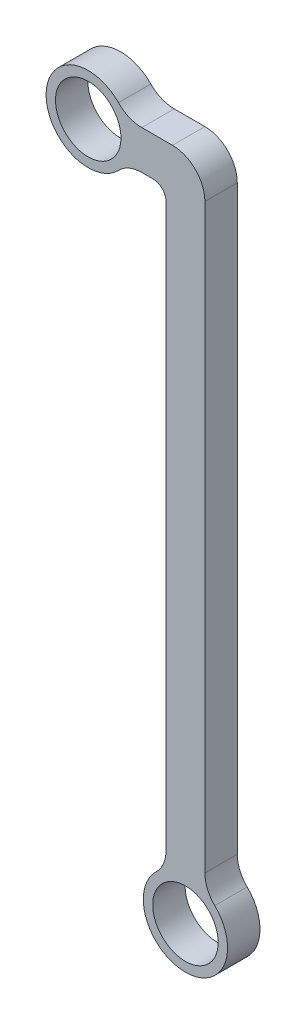
ISO-10303-21;
HEADER;
FILE_DESCRIPTION(('STEP AP214'),'2;1');
FILE_NAME('part.step','',(''),(''),'','','');
FILE_SCHEMA(('AUTOMOTIVE_DESIGN { 1 0 10303 214 1 1 1 1 }'));
ENDSEC;
DATA;
#1=APPLICATION_CONTEXT('core data for automotive mechanical design processes');
#2=APPLICATION_PROTOCOL_DEFINITION('international standard','automotive_design',2000,#1);
#3=PRODUCT_CONTEXT('',#1,'mechanical');
#4=PRODUCT('Part','Part','',(#3));
#5=PRODUCT_RELATED_PRODUCT_CATEGORY('part','',(#4));
#6=PRODUCT_DEFINITION_FORMATION('','',#4);
#7=PRODUCT_DEFINITION_CONTEXT('part definition',#1,'design');
#8=PRODUCT_DEFINITION('design','',#6,#7);
#9=PRODUCT_DEFINITION_SHAPE('','',#8);
#10=(LENGTH_UNIT() NAMED_UNIT(*) SI_UNIT(.MILLI.,.METRE.));
#11=(NAMED_UNIT(*) PLANE_ANGLE_UNIT() SI_UNIT($,.RADIAN.));
#12=(NAMED_UNIT(*) SI_UNIT($,.STERADIAN.) SOLID_ANGLE_UNIT());
#13=UNCERTAINTY_MEASURE_WITH_UNIT(LENGTH_MEASURE(1.E-05),#10,'distance_accuracy_value','');
#14=(GEOMETRIC_REPRESENTATION_CONTEXT(3) GLOBAL_UNCERTAINTY_ASSIGNED_CONTEXT((#13)) GLOBAL_UNIT_ASSIGNED_CONTEXT((#10,
#11,#12)) REPRESENTATION_CONTEXT('',''));
#15=CARTESIAN_POINT('',(0.,0.,0.));
#16=DIRECTION('',(0.,0.,1.));
#17=DIRECTION('',(1.,0.,0.));
#18=AXIS2_PLACEMENT_3D('',#15,#16,#17);
#19=CARTESIAN_POINT('',(12.7,-6.35,6.35));
#20=DIRECTION('',(0.,0.,1.));
#21=DIRECTION('',(1.,0.,0.));
#22=AXIS2_PLACEMENT_3D('',#19,#20,#21);
#23=PLANE('',#22);
#24=CARTESIAN_POINT('',(19.05,-127.,6.35));
#25=DIRECTION('',(0.,0.,1.));
#26=DIRECTION('',(1.,0.,0.));
#27=AXIS2_PLACEMENT_3D('',#24,#25,#26);
#28=CIRCLE('',#27,6.41349999999997);
#29=CARTESIAN_POINT('',(25.4635,-127.,6.35));
#30=VERTEX_POINT('',#29);
#31=EDGE_CURVE('E173',#30,#30,#28,.T.);
#32=ORIENTED_EDGE('',*,*,#31,.F.);
#33=EDGE_LOOP('',(#32));
#34=FACE_BOUND('',#33,.T.);
#35=CARTESIAN_POINT('',(12.7,-6.35,6.35));
#36=DIRECTION('',(0.,0.,-1.));
#37=DIRECTION('',(1.,0.,0.));
#38=AXIS2_PLACEMENT_3D('',#35,#36,#37);
#39=CIRCLE('',#38,2.54000000000001);
#40=CARTESIAN_POINT('',(12.7,-3.81,6.35));
#41=VERTEX_POINT('',#40);
#42=CARTESIAN_POINT('',(15.24,-6.35,6.35));
#43=VERTEX_POINT('',#42);
#44=EDGE_CURVE('E203',#41,#43,#39,.T.);
#45=ORIENTED_EDGE('',*,*,#44,.T.);
#46=DIRECTION('',(0.,-1.,0.));
#47=VECTOR('',#46,1.);
#48=CARTESIAN_POINT('',(15.24,-6.35,6.35));
#49=LINE('',#48,#47);
#50=CARTESIAN_POINT('',(15.24,-116.50807810742,6.35));
#51=VERTEX_POINT('',#50);
#52=EDGE_CURVE('E115',#43,#51,#49,.T.);
#53=ORIENTED_EDGE('',*,*,#52,.T.);
#54=CARTESIAN_POINT('',(8.89000000000001,-116.50807810742,6.35));
#55=DIRECTION('',(0.,0.,-1.));
#56=DIRECTION('',(-1.,0.,0.));
#57=AXIS2_PLACEMENT_3D('',#54,#55,#56);
#58=CIRCLE('',#57,6.35000000000001);
#59=CARTESIAN_POINT('',(13.3073913043478,-121.069783278107,6.35));
#60=VERTEX_POINT('',#59);
#61=EDGE_CURVE('E240',#51,#60,#58,.T.);
#62=ORIENTED_EDGE('',*,*,#61,.T.);
#63=CARTESIAN_POINT('',(19.05,-127.,6.35));
#64=DIRECTION('',(0.,0.,1.));
#65=DIRECTION('',(1.,0.,0.));
#66=AXIS2_PLACEMENT_3D('',#63,#64,#65);
#67=CIRCLE('',#66,8.25500000000002);
#68=CARTESIAN_POINT('',(24.7926086956522,-121.069783278107,6.35));
#69=VERTEX_POINT('',#68);
#70=EDGE_CURVE('E260',#60,#69,#67,.T.);
#71=ORIENTED_EDGE('',*,*,#70,.T.);
#72=CARTESIAN_POINT('',(29.21,-116.50807810742,6.35));
#73=DIRECTION('',(0.,0.,-1.));
#74=DIRECTION('',(1.,0.,0.));
#75=AXIS2_PLACEMENT_3D('',#72,#73,#74);
#76=CIRCLE('',#75,6.35000000000001);
#77=CARTESIAN_POINT('',(22.86,-116.50807810742,6.35));
#78=VERTEX_POINT('',#77);
#79=EDGE_CURVE('E256',#69,#78,#76,.T.);
#80=ORIENTED_EDGE('',*,*,#79,.T.);
#81=DIRECTION('',(0.,1.,0.));
#82=VECTOR('',#81,1.);
#83=CARTESIAN_POINT('',(22.86,-2.53999999999999,6.35));
#84=LINE('',#83,#82);
#85=CARTESIAN_POINT('',(22.86,-2.53999999999999,6.35));
#86=VERTEX_POINT('',#85);
#87=EDGE_CURVE('E259',#78,#86,#84,.T.);
#88=ORIENTED_EDGE('',*,*,#87,.T.);
#89=CARTESIAN_POINT('',(16.51,-2.53999999999999,6.35));
#90=DIRECTION('',(0.,0.,1.));
#91=DIRECTION('',(1.,0.,0.));
#92=AXIS2_PLACEMENT_3D('',#89,#90,#91);
#93=CIRCLE('',#92,6.35);
#94=CARTESIAN_POINT('',(16.51,3.81,6.35));
#95=VERTEX_POINT('',#94);
#96=EDGE_CURVE('E264',#86,#95,#93,.T.);
#97=ORIENTED_EDGE('',*,*,#96,.T.);
#98=DIRECTION('',(-1.,0.,0.));
#99=VECTOR('',#98,1.);
#100=CARTESIAN_POINT('',(10.49192189258,3.81,6.35));
#101=LINE('',#100,#99);
#102=CARTESIAN_POINT('',(10.49192189258,3.81,6.35));
#103=VERTEX_POINT('',#102);
#104=EDGE_CURVE('E271',#95,#103,#101,.T.);
#105=ORIENTED_EDGE('',*,*,#104,.T.);
#106=CARTESIAN_POINT('',(10.49192189258,10.16,6.35));
#107=DIRECTION('',(0.,0.,-1.));
#108=DIRECTION('',(-1.,0.,0.));
#109=AXIS2_PLACEMENT_3D('',#106,#107,#108);
#110=CIRCLE('',#109,6.34999999999999);
#111=CARTESIAN_POINT('',(5.93021672189308,5.74260869565216,6.35));
#112=VERTEX_POINT('',#111);
#113=EDGE_CURVE('E146',#103,#112,#110,.T.);
#114=ORIENTED_EDGE('',*,*,#113,.T.);
#115=CARTESIAN_POINT('',(0.,0.,6.35));
#116=DIRECTION('',(0.,0.,1.));
#117=DIRECTION('',(1.,0.,0.));
#118=AXIS2_PLACEMENT_3D('',#115,#116,#117);
#119=CIRCLE('',#118,8.25500000000002);
#120=CARTESIAN_POINT('',(5.93021672189309,-5.74260869565218,6.35));
#121=VERTEX_POINT('',#120);
#122=EDGE_CURVE('E140',#112,#121,#119,.T.);
#123=ORIENTED_EDGE('',*,*,#122,.T.);
#124=CARTESIAN_POINT('',(10.49192189258,-10.16,6.35));
#125=DIRECTION('',(0.,0.,-1.));
#126=DIRECTION('',(1.,0.,0.));
#127=AXIS2_PLACEMENT_3D('',#124,#125,#126);
#128=CIRCLE('',#127,6.34999999999999);
#129=CARTESIAN_POINT('',(10.49192189258,-3.81000000000001,6.35));
#130=VERTEX_POINT('',#129);
#131=EDGE_CURVE('E144',#121,#130,#128,.T.);
#132=ORIENTED_EDGE('',*,*,#131,.T.);
#133=DIRECTION('',(1.,0.,0.));
#134=VECTOR('',#133,1.);
#135=CARTESIAN_POINT('',(12.7,-3.81,6.35));
#136=LINE('',#135,#134);
#137=EDGE_CURVE('E60',#130,#41,#136,.T.);
#138=ORIENTED_EDGE('',*,*,#137,.T.);
#139=EDGE_LOOP('',(#45,#53,#62,#71,#80,#88,#97,#105,#114,#123,#132,#138));
#140=FACE_BOUND('',#139,.T.);
#141=CARTESIAN_POINT('',(0.,0.,6.35));
#142=DIRECTION('',(0.,0.,1.));
#143=DIRECTION('',(1.,0.,0.));
#144=AXIS2_PLACEMENT_3D('',#141,#142,#143);
#145=CIRCLE('',#144,6.41349999999998);
#146=CARTESIAN_POINT('',(6.41349999999998,0.,6.35));
#147=VERTEX_POINT('',#146);
#148=EDGE_CURVE('E315',#147,#147,#145,.T.);
#149=ORIENTED_EDGE('',*,*,#148,.F.);
#150=EDGE_LOOP('',(#149));
#151=FACE_BOUND('',#150,.T.);
#152=ADVANCED_FACE('F42',(#34,#140,#151),#23,.T.);
#153=CARTESIAN_POINT('',(12.7,-6.35,0.));
#154=DIRECTION('',(0.,0.,1.));
#155=DIRECTION('',(1.,0.,0.));
#156=AXIS2_PLACEMENT_3D('',#153,#154,#155);
#157=PLANE('',#156);
#158=CARTESIAN_POINT('',(12.7,-6.35,0.));
#159=DIRECTION('',(0.,0.,-1.));
#160=DIRECTION('',(1.,0.,0.));
#161=AXIS2_PLACEMENT_3D('',#158,#159,#160);
#162=CIRCLE('',#161,2.54000000000001);
#163=CARTESIAN_POINT('',(12.7,-3.81,0.));
#164=VERTEX_POINT('',#163);
#165=CARTESIAN_POINT('',(15.24,-6.35,0.));
#166=VERTEX_POINT('',#165);
#167=EDGE_CURVE('E168',#164,#166,#162,.T.);
#168=ORIENTED_EDGE('',*,*,#167,.F.);
#169=DIRECTION('',(1.,0.,0.));
#170=VECTOR('',#169,1.);
#171=CARTESIAN_POINT('',(12.7,-3.81,0.));
#172=LINE('',#171,#170);
#173=CARTESIAN_POINT('',(10.49192189258,-3.81000000000001,0.));
#174=VERTEX_POINT('',#173);
#175=EDGE_CURVE('E107',#174,#164,#172,.T.);
#176=ORIENTED_EDGE('',*,*,#175,.F.);
#177=CARTESIAN_POINT('',(10.49192189258,-10.16,0.));
#178=DIRECTION('',(0.,0.,-1.));
#179=DIRECTION('',(1.,0.,0.));
#180=AXIS2_PLACEMENT_3D('',#177,#178,#179);
#181=CIRCLE('',#180,6.34999999999999);
#182=CARTESIAN_POINT('',(5.93021672189309,-5.74260869565218,0.));
#183=VERTEX_POINT('',#182);
#184=EDGE_CURVE('E101',#183,#174,#181,.T.);
#185=ORIENTED_EDGE('',*,*,#184,.F.);
#186=CARTESIAN_POINT('',(0.,0.,0.));
#187=DIRECTION('',(0.,0.,1.));
#188=DIRECTION('',(1.,0.,0.));
#189=AXIS2_PLACEMENT_3D('',#186,#187,#188);
#190=CIRCLE('',#189,8.25500000000002);
#191=CARTESIAN_POINT('',(5.93021672189308,5.74260869565216,0.));
#192=VERTEX_POINT('',#191);
#193=EDGE_CURVE('E155',#192,#183,#190,.T.);
#194=ORIENTED_EDGE('',*,*,#193,.F.);
#195=CARTESIAN_POINT('',(10.49192189258,10.16,0.));
#196=DIRECTION('',(0.,0.,-1.));
#197=DIRECTION('',(-1.,0.,0.));
#198=AXIS2_PLACEMENT_3D('',#195,#196,#197);
#199=CIRCLE('',#198,6.34999999999999);
#200=CARTESIAN_POINT('',(10.49192189258,3.81,0.));
#201=VERTEX_POINT('',#200);
#202=EDGE_CURVE('E194',#201,#192,#199,.T.);
#203=ORIENTED_EDGE('',*,*,#202,.F.);
#204=DIRECTION('',(-1.,0.,0.));
#205=VECTOR('',#204,1.);
#206=CARTESIAN_POINT('',(10.49192189258,3.81,0.));
#207=LINE('',#206,#205);
#208=CARTESIAN_POINT('',(16.51,3.81,0.));
#209=VERTEX_POINT('',#208);
#210=EDGE_CURVE('E191',#209,#201,#207,.T.);
#211=ORIENTED_EDGE('',*,*,#210,.F.);
#212=CARTESIAN_POINT('',(16.51,-2.53999999999999,0.));
#213=DIRECTION('',(0.,0.,1.));
#214=DIRECTION('',(1.,0.,0.));
#215=AXIS2_PLACEMENT_3D('',#212,#213,#214);
#216=CIRCLE('',#215,6.35);
#217=CARTESIAN_POINT('',(22.86,-2.53999999999999,0.));
#218=VERTEX_POINT('',#217);
#219=EDGE_CURVE('E188',#218,#209,#216,.T.);
#220=ORIENTED_EDGE('',*,*,#219,.F.);
#221=DIRECTION('',(0.,1.,0.));
#222=VECTOR('',#221,1.);
#223=CARTESIAN_POINT('',(22.86,-2.53999999999999,0.));
#224=LINE('',#223,#222);
#225=CARTESIAN_POINT('',(22.86,-116.50807810742,0.));
#226=VERTEX_POINT('',#225);
#227=EDGE_CURVE('E185',#226,#218,#224,.T.);
#228=ORIENTED_EDGE('',*,*,#227,.F.);
#229=CARTESIAN_POINT('',(29.21,-116.50807810742,0.));
#230=DIRECTION('',(0.,0.,-1.));
#231=DIRECTION('',(1.,0.,0.));
#232=AXIS2_PLACEMENT_3D('',#229,#230,#231);
#233=CIRCLE('',#232,6.35000000000001);
#234=CARTESIAN_POINT('',(24.7926086956522,-121.069783278107,0.));
#235=VERTEX_POINT('',#234);
#236=EDGE_CURVE('E182',#235,#226,#233,.T.);
#237=ORIENTED_EDGE('',*,*,#236,.F.);
#238=CARTESIAN_POINT('',(19.05,-127.,0.));
#239=DIRECTION('',(0.,0.,1.));
#240=DIRECTION('',(1.,0.,0.));
#241=AXIS2_PLACEMENT_3D('',#238,#239,#240);
#242=CIRCLE('',#241,8.25500000000002);
#243=CARTESIAN_POINT('',(13.3073913043478,-121.069783278107,0.));
#244=VERTEX_POINT('',#243);
#245=EDGE_CURVE('E179',#244,#235,#242,.T.);
#246=ORIENTED_EDGE('',*,*,#245,.F.);
#247=CARTESIAN_POINT('',(8.89000000000001,-116.50807810742,0.));
#248=DIRECTION('',(0.,0.,-1.));
#249=DIRECTION('',(-1.,0.,0.));
#250=AXIS2_PLACEMENT_3D('',#247,#248,#249);
#251=CIRCLE('',#250,6.35000000000001);
#252=CARTESIAN_POINT('',(15.24,-116.50807810742,0.));
#253=VERTEX_POINT('',#252);
#254=EDGE_CURVE('E176',#253,#244,#251,.T.);
#255=ORIENTED_EDGE('',*,*,#254,.F.);
#256=DIRECTION('',(0.,-1.,0.));
#257=VECTOR('',#256,1.);
#258=CARTESIAN_POINT('',(15.24,-6.35,0.));
#259=LINE('',#258,#257);
#260=EDGE_CURVE('E172',#166,#253,#259,.T.);
#261=ORIENTED_EDGE('',*,*,#260,.F.);
#262=EDGE_LOOP('',(#168,#176,#185,#194,#203,#211,#220,#228,#237,#246,#255,#261));
#263=FACE_BOUND('',#262,.T.);
#264=CARTESIAN_POINT('',(19.05,-127.,0.));
#265=DIRECTION('',(0.,0.,1.));
#266=DIRECTION('',(1.,0.,0.));
#267=AXIS2_PLACEMENT_3D('',#264,#265,#266);
#268=CIRCLE('',#267,6.41349999999997);
#269=CARTESIAN_POINT('',(25.4635,-127.,0.));
#270=VERTEX_POINT('',#269);
#271=EDGE_CURVE('E323',#270,#270,#268,.T.);
#272=ORIENTED_EDGE('',*,*,#271,.T.);
#273=EDGE_LOOP('',(#272));
#274=FACE_BOUND('',#273,.T.);
#275=CARTESIAN_POINT('',(0.,0.,0.));
#276=DIRECTION('',(0.,0.,1.));
#277=DIRECTION('',(1.,0.,0.));
#278=AXIS2_PLACEMENT_3D('',#275,#276,#277);
#279=CIRCLE('',#278,6.41349999999998);
#280=CARTESIAN_POINT('',(6.41349999999998,0.,0.));
#281=VERTEX_POINT('',#280);
#282=EDGE_CURVE('E318',#281,#281,#279,.T.);
#283=ORIENTED_EDGE('',*,*,#282,.T.);
#284=EDGE_LOOP('',(#283));
#285=FACE_BOUND('',#284,.T.);
#286=ADVANCED_FACE('F244',(#263,#274,#285),#157,.F.);
#287=CARTESIAN_POINT('',(12.7,-6.35,6.35));
#288=DIRECTION('',(0.,0.,-1.));
#289=DIRECTION('',(-1.,0.,0.));
#290=AXIS2_PLACEMENT_3D('',#287,#288,#289);
#291=CYLINDRICAL_SURFACE('',#290,2.54000000000001);
#292=ORIENTED_EDGE('',*,*,#167,.T.);
#293=DIRECTION('',(0.,0.,-1.));
#294=VECTOR('',#293,1.);
#295=CARTESIAN_POINT('',(15.24,-6.35,6.35));
#296=LINE('',#295,#294);
#297=EDGE_CURVE('E11',#43,#166,#296,.T.);
#298=ORIENTED_EDGE('',*,*,#297,.F.);
#299=ORIENTED_EDGE('',*,*,#44,.F.);
#300=DIRECTION('',(0.,0.,-1.));
#301=VECTOR('',#300,1.);
#302=CARTESIAN_POINT('',(12.7,-3.81,6.35));
#303=LINE('',#302,#301);
#304=EDGE_CURVE('E164',#41,#164,#303,.T.);
#305=ORIENTED_EDGE('',*,*,#304,.T.);
#306=EDGE_LOOP('',(#292,#298,#299,#305));
#307=FACE_BOUND('',#306,.T.);
#308=ADVANCED_FACE('F44',(#307),#291,.F.);
#309=CARTESIAN_POINT('',(15.24,-6.35,6.35));
#310=DIRECTION('',(1.,0.,0.));
#311=DIRECTION('',(0.,0.,-1.));
#312=AXIS2_PLACEMENT_3D('',#309,#310,#311);
#313=PLANE('',#312);
#314=ORIENTED_EDGE('',*,*,#260,.T.);
#315=DIRECTION('',(0.,0.,-1.));
#316=VECTOR('',#315,1.);
#317=CARTESIAN_POINT('',(15.24,-116.50807810742,6.35));
#318=LINE('',#317,#316);
#319=EDGE_CURVE('E52',#51,#253,#318,.T.);
#320=ORIENTED_EDGE('',*,*,#319,.F.);
#321=ORIENTED_EDGE('',*,*,#52,.F.);
#322=ORIENTED_EDGE('',*,*,#297,.T.);
#323=EDGE_LOOP('',(#314,#320,#321,#322));
#324=FACE_BOUND('',#323,.T.);
#325=ADVANCED_FACE('F431',(#324),#313,.F.);
#326=CARTESIAN_POINT('',(8.89000000000001,-116.50807810742,6.35));
#327=DIRECTION('',(0.,0.,-1.));
#328=DIRECTION('',(-1.,0.,0.));
#329=AXIS2_PLACEMENT_3D('',#326,#327,#328);
#330=CYLINDRICAL_SURFACE('',#329,6.35000000000001);
#331=ORIENTED_EDGE('',*,*,#254,.T.);
#332=DIRECTION('',(0.,0.,-1.));
#333=VECTOR('',#332,1.);
#334=CARTESIAN_POINT('',(13.3073913043478,-121.069783278107,6.35));
#335=LINE('',#334,#333);
#336=EDGE_CURVE('E230',#60,#244,#335,.T.);
#337=ORIENTED_EDGE('',*,*,#336,.F.);
#338=ORIENTED_EDGE('',*,*,#61,.F.);
#339=ORIENTED_EDGE('',*,*,#319,.T.);
#340=EDGE_LOOP('',(#331,#337,#338,#339));
#341=FACE_BOUND('',#340,.T.);
#342=ADVANCED_FACE('F238',(#341),#330,.F.);
#343=CARTESIAN_POINT('',(19.05,-127.,6.35));
#344=DIRECTION('',(0.,0.,-1.));
#345=DIRECTION('',(-1.,0.,0.));
#346=AXIS2_PLACEMENT_3D('',#343,#344,#345);
#347=CYLINDRICAL_SURFACE('',#346,8.25500000000002);
#348=ORIENTED_EDGE('',*,*,#245,.T.);
#349=DIRECTION('',(0.,0.,-1.));
#350=VECTOR('',#349,1.);
#351=CARTESIAN_POINT('',(24.7926086956522,-121.069783278107,6.35));
#352=LINE('',#351,#350);
#353=EDGE_CURVE('E226',#69,#235,#352,.T.);
#354=ORIENTED_EDGE('',*,*,#353,.F.);
#355=ORIENTED_EDGE('',*,*,#70,.F.);
#356=ORIENTED_EDGE('',*,*,#336,.T.);
#357=EDGE_LOOP('',(#348,#354,#355,#356));
#358=FACE_BOUND('',#357,.T.);
#359=ADVANCED_FACE('F250',(#358),#347,.T.);
#360=CARTESIAN_POINT('',(29.21,-116.50807810742,6.35));
#361=DIRECTION('',(0.,0.,-1.));
#362=DIRECTION('',(-1.,0.,0.));
#363=AXIS2_PLACEMENT_3D('',#360,#361,#362);
#364=CYLINDRICAL_SURFACE('',#363,6.35000000000001);
#365=ORIENTED_EDGE('',*,*,#236,.T.);
#366=DIRECTION('',(0.,0.,-1.));
#367=VECTOR('',#366,1.);
#368=CARTESIAN_POINT('',(22.86,-116.50807810742,6.35));
#369=LINE('',#368,#367);
#370=EDGE_CURVE('E222',#78,#226,#369,.T.);
#371=ORIENTED_EDGE('',*,*,#370,.F.);
#372=ORIENTED_EDGE('',*,*,#79,.F.);
#373=ORIENTED_EDGE('',*,*,#353,.T.);
#374=EDGE_LOOP('',(#365,#371,#372,#373));
#375=FACE_BOUND('',#374,.T.);
#376=ADVANCED_FACE('F254',(#375),#364,.F.);
#377=CARTESIAN_POINT('',(22.86,-2.53999999999999,6.35));
#378=DIRECTION('',(-1.,0.,0.));
#379=DIRECTION('',(0.,0.,1.));
#380=AXIS2_PLACEMENT_3D('',#377,#378,#379);
#381=PLANE('',#380);
#382=ORIENTED_EDGE('',*,*,#227,.T.);
#383=DIRECTION('',(0.,0.,-1.));
#384=VECTOR('',#383,1.);
#385=CARTESIAN_POINT('',(22.86,-2.53999999999999,6.35));
#386=LINE('',#385,#384);
#387=EDGE_CURVE('E218',#86,#218,#386,.T.);
#388=ORIENTED_EDGE('',*,*,#387,.F.);
#389=ORIENTED_EDGE('',*,*,#87,.F.);
#390=ORIENTED_EDGE('',*,*,#370,.T.);
#391=EDGE_LOOP('',(#382,#388,#389,#390));
#392=FACE_BOUND('',#391,.T.);
#393=ADVANCED_FACE('F392',(#392),#381,.F.);
#394=CARTESIAN_POINT('',(16.51,-2.53999999999999,6.35));
#395=DIRECTION('',(0.,0.,-1.));
#396=DIRECTION('',(-1.,0.,0.));
#397=AXIS2_PLACEMENT_3D('',#394,#395,#396);
#398=CYLINDRICAL_SURFACE('',#397,6.35);
#399=ORIENTED_EDGE('',*,*,#219,.T.);
#400=DIRECTION('',(0.,0.,-1.));
#401=VECTOR('',#400,1.);
#402=CARTESIAN_POINT('',(16.51,3.81,6.35));
#403=LINE('',#402,#401);
#404=EDGE_CURVE('E214',#95,#209,#403,.T.);
#405=ORIENTED_EDGE('',*,*,#404,.F.);
#406=ORIENTED_EDGE('',*,*,#96,.F.);
#407=ORIENTED_EDGE('',*,*,#387,.T.);
#408=EDGE_LOOP('',(#399,#405,#406,#407));
#409=FACE_BOUND('',#408,.T.);
#410=ADVANCED_FACE('F382',(#409),#398,.T.);
#411=CARTESIAN_POINT('',(10.49192189258,3.81,6.35));
#412=DIRECTION('',(0.,-1.,0.));
#413=DIRECTION('',(1.,0.,0.));
#414=AXIS2_PLACEMENT_3D('',#411,#412,#413);
#415=PLANE('',#414);
#416=ORIENTED_EDGE('',*,*,#210,.T.);
#417=DIRECTION('',(0.,0.,-1.));
#418=VECTOR('',#417,1.);
#419=CARTESIAN_POINT('',(10.49192189258,3.81,6.35));
#420=LINE('',#419,#418);
#421=EDGE_CURVE('E210',#103,#201,#420,.T.);
#422=ORIENTED_EDGE('',*,*,#421,.F.);
#423=ORIENTED_EDGE('',*,*,#104,.F.);
#424=ORIENTED_EDGE('',*,*,#404,.T.);
#425=EDGE_LOOP('',(#416,#422,#423,#424));
#426=FACE_BOUND('',#425,.T.);
#427=ADVANCED_FACE('F279',(#426),#415,.F.);
#428=CARTESIAN_POINT('',(10.49192189258,10.16,6.35));
#429=DIRECTION('',(0.,0.,-1.));
#430=DIRECTION('',(-1.,0.,0.));
#431=AXIS2_PLACEMENT_3D('',#428,#429,#430);
#432=CYLINDRICAL_SURFACE('',#431,6.34999999999999);
#433=ORIENTED_EDGE('',*,*,#202,.T.);
#434=DIRECTION('',(0.,0.,-1.));
#435=VECTOR('',#434,1.);
#436=CARTESIAN_POINT('',(5.93021672189308,5.74260869565216,6.35));
#437=LINE('',#436,#435);
#438=EDGE_CURVE('E157',#112,#192,#437,.T.);
#439=ORIENTED_EDGE('',*,*,#438,.F.);
#440=ORIENTED_EDGE('',*,*,#113,.F.);
#441=ORIENTED_EDGE('',*,*,#421,.T.);
#442=EDGE_LOOP('',(#433,#439,#440,#441));
#443=FACE_BOUND('',#442,.T.);
#444=ADVANCED_FACE('F283',(#443),#432,.F.);
#445=CARTESIAN_POINT('',(0.,0.,6.35));
#446=DIRECTION('',(0.,0.,-1.));
#447=DIRECTION('',(-1.,0.,0.));
#448=AXIS2_PLACEMENT_3D('',#445,#446,#447);
#449=CYLINDRICAL_SURFACE('',#448,8.25500000000002);
#450=ORIENTED_EDGE('',*,*,#193,.T.);
#451=DIRECTION('',(0.,0.,-1.));
#452=VECTOR('',#451,1.);
#453=CARTESIAN_POINT('',(5.93021672189309,-5.74260869565218,6.35));
#454=LINE('',#453,#452);
#455=EDGE_CURVE('E152',#121,#183,#454,.T.);
#456=ORIENTED_EDGE('',*,*,#455,.F.);
#457=ORIENTED_EDGE('',*,*,#122,.F.);
#458=ORIENTED_EDGE('',*,*,#438,.T.);
#459=EDGE_LOOP('',(#450,#456,#457,#458));
#460=FACE_BOUND('',#459,.T.);
#461=ADVANCED_FACE('F153',(#460),#449,.T.);
#462=CARTESIAN_POINT('',(10.49192189258,-10.16,6.35));
#463=DIRECTION('',(0.,0.,-1.));
#464=DIRECTION('',(-1.,0.,0.));
#465=AXIS2_PLACEMENT_3D('',#462,#463,#464);
#466=CYLINDRICAL_SURFACE('',#465,6.34999999999999);
#467=ORIENTED_EDGE('',*,*,#184,.T.);
#468=DIRECTION('',(0.,0.,-1.));
#469=VECTOR('',#468,1.);
#470=CARTESIAN_POINT('',(10.49192189258,-3.81000000000001,6.35));
#471=LINE('',#470,#469);
#472=EDGE_CURVE('E158',#130,#174,#471,.T.);
#473=ORIENTED_EDGE('',*,*,#472,.F.);
#474=ORIENTED_EDGE('',*,*,#131,.F.);
#475=ORIENTED_EDGE('',*,*,#455,.T.);
#476=EDGE_LOOP('',(#467,#473,#474,#475));
#477=FACE_BOUND('',#476,.T.);
#478=ADVANCED_FACE('F160',(#477),#466,.F.);
#479=CARTESIAN_POINT('',(12.7,-3.81,6.35));
#480=DIRECTION('',(0.,1.,0.));
#481=DIRECTION('',(-1.,0.,0.));
#482=AXIS2_PLACEMENT_3D('',#479,#480,#481);
#483=PLANE('',#482);
#484=ORIENTED_EDGE('',*,*,#175,.T.);
#485=ORIENTED_EDGE('',*,*,#304,.F.);
#486=ORIENTED_EDGE('',*,*,#137,.F.);
#487=ORIENTED_EDGE('',*,*,#472,.T.);
#488=EDGE_LOOP('',(#484,#485,#486,#487));
#489=FACE_BOUND('',#488,.T.);
#490=ADVANCED_FACE('F287',(#489),#483,.F.);
#491=CARTESIAN_POINT('',(19.05,-127.,6.35));
#492=DIRECTION('',(0.,0.,-1.));
#493=DIRECTION('',(-1.,0.,0.));
#494=AXIS2_PLACEMENT_3D('',#491,#492,#493);
#495=CYLINDRICAL_SURFACE('',#494,6.41349999999997);
#496=ORIENTED_EDGE('',*,*,#31,.T.);
#497=EDGE_LOOP('',(#496));
#498=FACE_BOUND('',#497,.T.);
#499=ORIENTED_EDGE('',*,*,#271,.F.);
#500=EDGE_LOOP('',(#499));
#501=FACE_BOUND('',#500,.T.);
#502=ADVANCED_FACE('F289',(#498,#501),#495,.F.);
#503=CARTESIAN_POINT('',(0.,0.,6.35));
#504=DIRECTION('',(0.,0.,-1.));
#505=DIRECTION('',(-1.,0.,0.));
#506=AXIS2_PLACEMENT_3D('',#503,#504,#505);
#507=CYLINDRICAL_SURFACE('',#506,6.41349999999998);
#508=ORIENTED_EDGE('',*,*,#148,.T.);
#509=EDGE_LOOP('',(#508));
#510=FACE_BOUND('',#509,.T.);
#511=ORIENTED_EDGE('',*,*,#282,.F.);
#512=EDGE_LOOP('',(#511));
#513=FACE_BOUND('',#512,.T.);
#514=ADVANCED_FACE('F295',(#510,#513),#507,.F.);
#515=CLOSED_SHELL('',(#152,#286,#308,#325,#342,#359,#376,#393,#410,#427,#444,#461,#478,#490,
#502,#514));
#516=MANIFOLD_SOLID_BREP('B2',#515);
#517=ADVANCED_BREP_SHAPE_REPRESENTATION('',(#18,#516),#14);
#518=SHAPE_DEFINITION_REPRESENTATION(#9,#517);
ENDSEC;
END-ISO-10303-21;
